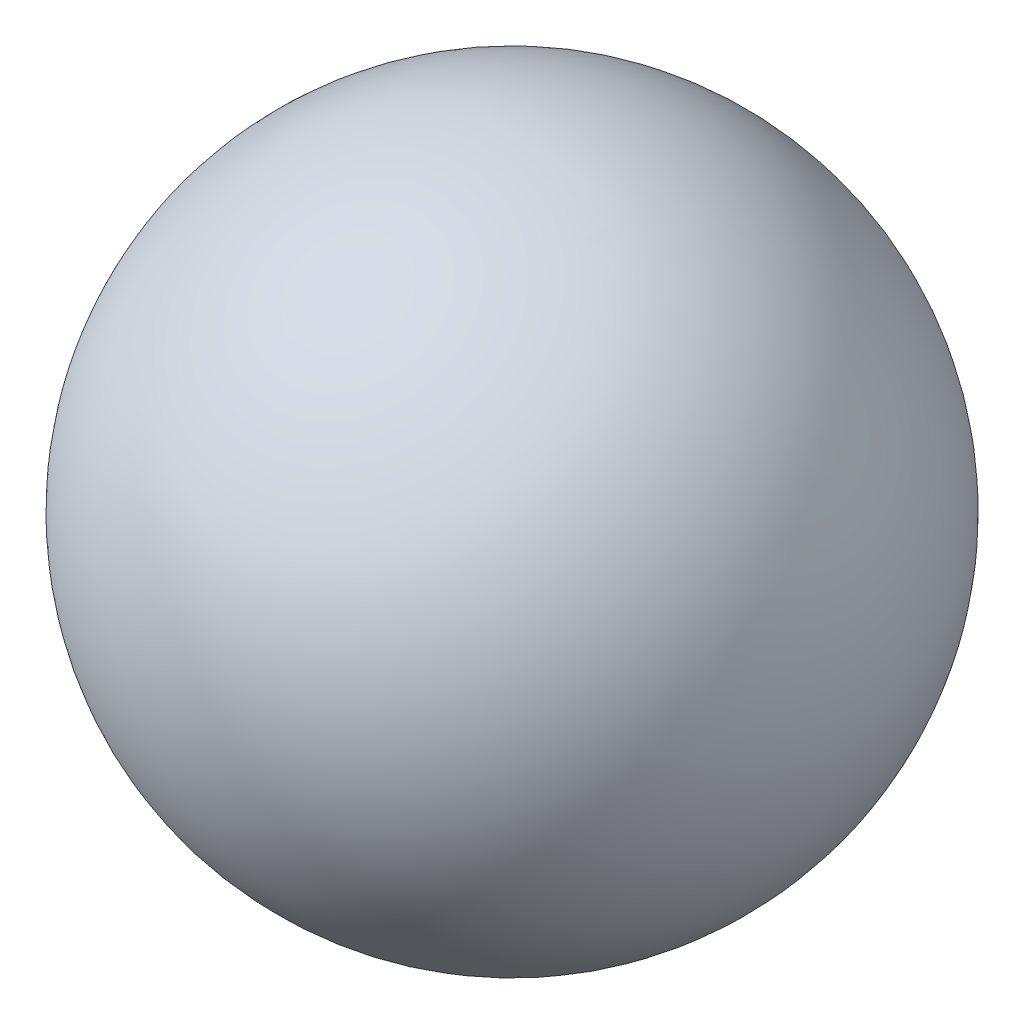
ISO-10303-21;
HEADER;
FILE_DESCRIPTION(('STEP AP214'),'2;1');
FILE_NAME('part.step','',(''),(''),'','','');
FILE_SCHEMA(('AUTOMOTIVE_DESIGN { 1 0 10303 214 1 1 1 1 }'));
ENDSEC;
DATA;
#1=APPLICATION_CONTEXT('core data for automotive mechanical design processes');
#2=APPLICATION_PROTOCOL_DEFINITION('international standard','automotive_design',2000,#1);
#3=PRODUCT_CONTEXT('',#1,'mechanical');
#4=PRODUCT('Part','Part','',(#3));
#5=PRODUCT_RELATED_PRODUCT_CATEGORY('part','',(#4));
#6=PRODUCT_DEFINITION_FORMATION('','',#4);
#7=PRODUCT_DEFINITION_CONTEXT('part definition',#1,'design');
#8=PRODUCT_DEFINITION('design','',#6,#7);
#9=PRODUCT_DEFINITION_SHAPE('','',#8);
#10=(LENGTH_UNIT() NAMED_UNIT(*) SI_UNIT(.MILLI.,.METRE.));
#11=(NAMED_UNIT(*) PLANE_ANGLE_UNIT() SI_UNIT($,.RADIAN.));
#12=(NAMED_UNIT(*) SI_UNIT($,.STERADIAN.) SOLID_ANGLE_UNIT());
#13=UNCERTAINTY_MEASURE_WITH_UNIT(LENGTH_MEASURE(1.E-05),#10,'distance_accuracy_value','');
#14=(GEOMETRIC_REPRESENTATION_CONTEXT(3) GLOBAL_UNCERTAINTY_ASSIGNED_CONTEXT((#13)) GLOBAL_UNIT_ASSIGNED_CONTEXT((#10,
#11,#12)) REPRESENTATION_CONTEXT('',''));
#15=CARTESIAN_POINT('',(0.,0.,0.));
#16=DIRECTION('',(0.,0.,1.));
#17=DIRECTION('',(1.,0.,0.));
#18=AXIS2_PLACEMENT_3D('',#15,#16,#17);
#19=CARTESIAN_POINT('',(-9.81371442752059,3.18866911070661,0.));
#20=DIRECTION('',(1.,0.,0.));
#21=DIRECTION('',(0.,1.,0.));
#22=AXIS2_PLACEMENT_3D('',#19,#20,#21);
#23=SPHERICAL_SURFACE('',#22,1.71627890103155);
#24=CARTESIAN_POINT('',(-8.09743552648904,3.18866911070661,0.));
#25=VERTEX_POINT('',#24);
#26=VERTEX_LOOP('',#25);
#27=FACE_BOUND('',#26,.T.);
#28=CARTESIAN_POINT('',(-11.5299933285521,3.18866911070661,0.));
#29=VERTEX_POINT('',#28);
#30=VERTEX_LOOP('',#29);
#31=FACE_BOUND('',#30,.T.);
#32=ADVANCED_FACE('F16',(#27,#31),#23,.T.);
#33=CLOSED_SHELL('',(#32));
#34=MANIFOLD_SOLID_BREP('B1',#33);
#35=ADVANCED_BREP_SHAPE_REPRESENTATION('',(#18,#34),#14);
#36=SHAPE_DEFINITION_REPRESENTATION(#9,#35);
ENDSEC;
END-ISO-10303-21;
